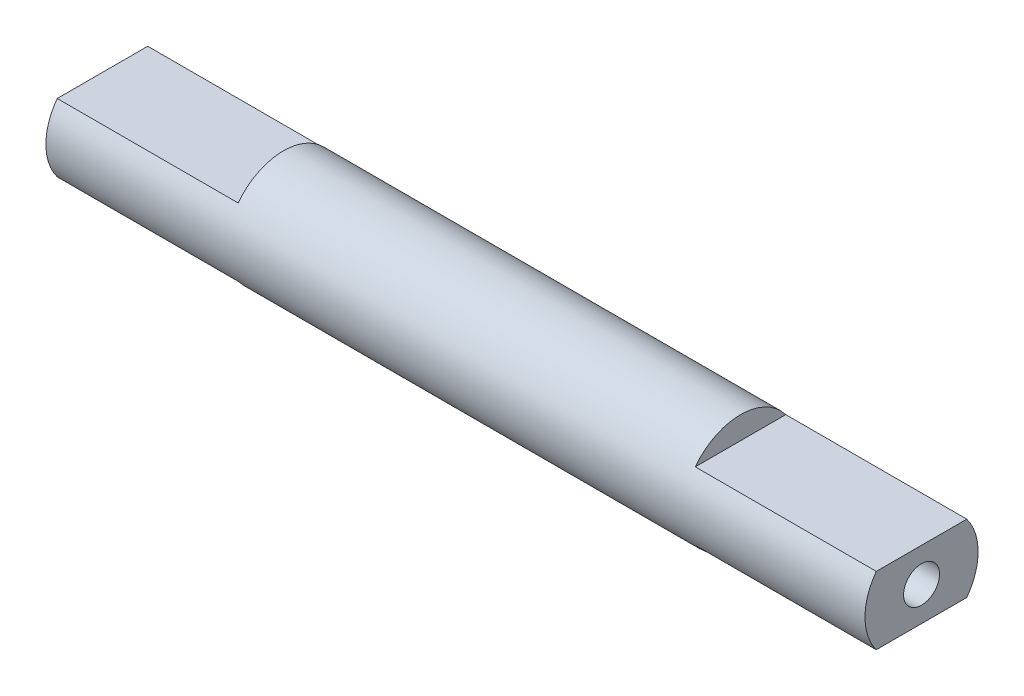
ISO-10303-21;
HEADER;
FILE_DESCRIPTION(('STEP AP214'),'2;1');
FILE_NAME('part.step','',(''),(''),'','','');
FILE_SCHEMA(('AUTOMOTIVE_DESIGN { 1 0 10303 214 1 1 1 1 }'));
ENDSEC;
DATA;
#1=APPLICATION_CONTEXT('core data for automotive mechanical design processes');
#2=APPLICATION_PROTOCOL_DEFINITION('international standard','automotive_design',2000,#1);
#3=PRODUCT_CONTEXT('',#1,'mechanical');
#4=PRODUCT('Part','Part','',(#3));
#5=PRODUCT_RELATED_PRODUCT_CATEGORY('part','',(#4));
#6=PRODUCT_DEFINITION_FORMATION('','',#4);
#7=PRODUCT_DEFINITION_CONTEXT('part definition',#1,'design');
#8=PRODUCT_DEFINITION('design','',#6,#7);
#9=PRODUCT_DEFINITION_SHAPE('','',#8);
#10=(LENGTH_UNIT() NAMED_UNIT(*) SI_UNIT(.MILLI.,.METRE.));
#11=(NAMED_UNIT(*) PLANE_ANGLE_UNIT() SI_UNIT($,.RADIAN.));
#12=(NAMED_UNIT(*) SI_UNIT($,.STERADIAN.) SOLID_ANGLE_UNIT());
#13=UNCERTAINTY_MEASURE_WITH_UNIT(LENGTH_MEASURE(1.E-05),#10,'distance_accuracy_value','');
#14=(GEOMETRIC_REPRESENTATION_CONTEXT(3) GLOBAL_UNCERTAINTY_ASSIGNED_CONTEXT((#13)) GLOBAL_UNIT_ASSIGNED_CONTEXT((#10,
#11,#12)) REPRESENTATION_CONTEXT('',''));
#15=CARTESIAN_POINT('',(0.,0.,0.));
#16=DIRECTION('',(0.,0.,1.));
#17=DIRECTION('',(1.,0.,0.));
#18=AXIS2_PLACEMENT_3D('',#15,#16,#17);
#19=CARTESIAN_POINT('',(36.2,0.,0.));
#20=DIRECTION('',(-1.,0.,0.));
#21=DIRECTION('',(0.,0.,1.));
#22=AXIS2_PLACEMENT_3D('',#19,#20,#21);
#23=CYLINDRICAL_SURFACE('',#22,2.5);
#24=CARTESIAN_POINT('',(8.,0.,0.));
#25=DIRECTION('',(1.,0.,0.));
#26=DIRECTION('',(0.,0.,-1.));
#27=AXIS2_PLACEMENT_3D('',#24,#25,#26);
#28=CIRCLE('',#27,2.5);
#29=CARTESIAN_POINT('',(8.,-1.5,2.));
#30=VERTEX_POINT('',#29);
#31=CARTESIAN_POINT('',(8.,-1.5,-2.));
#32=VERTEX_POINT('',#31);
#33=EDGE_CURVE('E62',#30,#32,#28,.T.);
#34=ORIENTED_EDGE('',*,*,#33,.T.);
#35=DIRECTION('',(-1.,0.,0.));
#36=VECTOR('',#35,1.);
#37=CARTESIAN_POINT('',(8.,-1.5,-2.));
#38=LINE('',#37,#36);
#39=CARTESIAN_POINT('',(0.,-1.5,-2.));
#40=VERTEX_POINT('',#39);
#41=EDGE_CURVE('E184',#32,#40,#38,.T.);
#42=ORIENTED_EDGE('',*,*,#41,.T.);
#43=CARTESIAN_POINT('',(0.,0.,0.));
#44=DIRECTION('',(1.,0.,0.));
#45=DIRECTION('',(0.,0.,-1.));
#46=AXIS2_PLACEMENT_3D('',#43,#44,#45);
#47=CIRCLE('',#46,2.5);
#48=CARTESIAN_POINT('',(0.,1.5,-2.));
#49=VERTEX_POINT('',#48);
#50=EDGE_CURVE('E138',#40,#49,#47,.T.);
#51=ORIENTED_EDGE('',*,*,#50,.T.);
#52=DIRECTION('',(-1.,0.,0.));
#53=VECTOR('',#52,1.);
#54=CARTESIAN_POINT('',(8.,1.5,-2.));
#55=LINE('',#54,#53);
#56=CARTESIAN_POINT('',(8.,1.5,-2.));
#57=VERTEX_POINT('',#56);
#58=EDGE_CURVE('E81',#57,#49,#55,.T.);
#59=ORIENTED_EDGE('',*,*,#58,.F.);
#60=CARTESIAN_POINT('',(8.,1.5,2.));
#61=VERTEX_POINT('',#60);
#62=EDGE_CURVE('E13',#57,#61,#28,.T.);
#63=ORIENTED_EDGE('',*,*,#62,.T.);
#64=DIRECTION('',(-1.,0.,0.));
#65=VECTOR('',#64,1.);
#66=CARTESIAN_POINT('',(8.,1.5,2.));
#67=LINE('',#66,#65);
#68=CARTESIAN_POINT('',(0.,1.5,2.));
#69=VERTEX_POINT('',#68);
#70=EDGE_CURVE('E129',#61,#69,#67,.T.);
#71=ORIENTED_EDGE('',*,*,#70,.T.);
#72=CARTESIAN_POINT('',(0.,-1.5,2.));
#73=VERTEX_POINT('',#72);
#74=EDGE_CURVE('E169',#69,#73,#47,.T.);
#75=ORIENTED_EDGE('',*,*,#74,.T.);
#76=DIRECTION('',(-1.,0.,0.));
#77=VECTOR('',#76,1.);
#78=CARTESIAN_POINT('',(8.,-1.5,2.));
#79=LINE('',#78,#77);
#80=EDGE_CURVE('E73',#30,#73,#79,.T.);
#81=ORIENTED_EDGE('',*,*,#80,.F.);
#82=EDGE_LOOP('',(#34,#42,#51,#59,#63,#71,#75,#81));
#83=FACE_BOUND('',#82,.T.);
#84=CARTESIAN_POINT('',(36.2,0.,0.));
#85=DIRECTION('',(1.,0.,0.));
#86=DIRECTION('',(0.,0.,-1.));
#87=AXIS2_PLACEMENT_3D('',#84,#85,#86);
#88=CIRCLE('',#87,2.5);
#89=CARTESIAN_POINT('',(36.2,1.5,2.));
#90=VERTEX_POINT('',#89);
#91=CARTESIAN_POINT('',(36.2,-1.5,2.));
#92=VERTEX_POINT('',#91);
#93=EDGE_CURVE('E168',#90,#92,#88,.T.);
#94=ORIENTED_EDGE('',*,*,#93,.F.);
#95=DIRECTION('',(-1.,0.,0.));
#96=VECTOR('',#95,1.);
#97=CARTESIAN_POINT('',(36.2,1.5,2.));
#98=LINE('',#97,#96);
#99=CARTESIAN_POINT('',(28.2,1.5,2.));
#100=VERTEX_POINT('',#99);
#101=EDGE_CURVE('E162',#90,#100,#98,.T.);
#102=ORIENTED_EDGE('',*,*,#101,.T.);
#103=CARTESIAN_POINT('',(28.2,0.,0.));
#104=DIRECTION('',(1.,0.,0.));
#105=DIRECTION('',(0.,0.,-1.));
#106=AXIS2_PLACEMENT_3D('',#103,#104,#105);
#107=CIRCLE('',#106,2.5);
#108=CARTESIAN_POINT('',(28.2,1.5,-2.));
#109=VERTEX_POINT('',#108);
#110=EDGE_CURVE('E176',#109,#100,#107,.T.);
#111=ORIENTED_EDGE('',*,*,#110,.F.);
#112=DIRECTION('',(-1.,0.,0.));
#113=VECTOR('',#112,1.);
#114=CARTESIAN_POINT('',(36.2,1.5,-2.));
#115=LINE('',#114,#113);
#116=CARTESIAN_POINT('',(36.2,1.5,-2.));
#117=VERTEX_POINT('',#116);
#118=EDGE_CURVE('E159',#109,#117,#115,.F.);
#119=ORIENTED_EDGE('',*,*,#118,.T.);
#120=CARTESIAN_POINT('',(36.2,-1.5,-2.));
#121=VERTEX_POINT('',#120);
#122=EDGE_CURVE('E165',#121,#117,#88,.T.);
#123=ORIENTED_EDGE('',*,*,#122,.F.);
#124=DIRECTION('',(-1.,0.,0.));
#125=VECTOR('',#124,1.);
#126=CARTESIAN_POINT('',(36.2,-1.5,-2.));
#127=LINE('',#126,#125);
#128=CARTESIAN_POINT('',(28.2,-1.5,-2.));
#129=VERTEX_POINT('',#128);
#130=EDGE_CURVE('E155',#129,#121,#127,.F.);
#131=ORIENTED_EDGE('',*,*,#130,.F.);
#132=CARTESIAN_POINT('',(28.2,-1.5,2.));
#133=VERTEX_POINT('',#132);
#134=EDGE_CURVE('E175',#133,#129,#107,.T.);
#135=ORIENTED_EDGE('',*,*,#134,.F.);
#136=DIRECTION('',(-1.,0.,0.));
#137=VECTOR('',#136,1.);
#138=CARTESIAN_POINT('',(36.2,-1.5,2.));
#139=LINE('',#138,#137);
#140=EDGE_CURVE('E157',#92,#133,#139,.T.);
#141=ORIENTED_EDGE('',*,*,#140,.F.);
#142=EDGE_LOOP('',(#94,#102,#111,#119,#123,#131,#135,#141));
#143=FACE_BOUND('',#142,.T.);
#144=ADVANCED_FACE('F59',(#83,#143),#23,.T.);
#145=CARTESIAN_POINT('',(36.2,0.,0.));
#146=DIRECTION('',(1.,0.,0.));
#147=DIRECTION('',(0.,0.,-1.));
#148=AXIS2_PLACEMENT_3D('',#145,#146,#147);
#149=PLANE('',#148);
#150=CARTESIAN_POINT('',(36.2,0.,0.));
#151=DIRECTION('',(1.,0.,0.));
#152=DIRECTION('',(0.,0.,-1.));
#153=AXIS2_PLACEMENT_3D('',#150,#151,#152);
#154=CIRCLE('',#153,0.79375);
#155=CARTESIAN_POINT('',(36.2,0.,-0.793749999999999));
#156=VERTEX_POINT('',#155);
#157=EDGE_CURVE('E139',#156,#156,#154,.T.);
#158=ORIENTED_EDGE('',*,*,#157,.F.);
#159=EDGE_LOOP('',(#158));
#160=FACE_BOUND('',#159,.T.);
#161=DIRECTION('',(0.,0.,-1.));
#162=VECTOR('',#161,1.);
#163=CARTESIAN_POINT('',(36.2,1.5,0.));
#164=LINE('',#163,#162);
#165=EDGE_CURVE('E174',#90,#117,#164,.T.);
#166=ORIENTED_EDGE('',*,*,#165,.F.);
#167=ORIENTED_EDGE('',*,*,#93,.T.);
#168=DIRECTION('',(0.,0.,-1.));
#169=VECTOR('',#168,1.);
#170=CARTESIAN_POINT('',(36.2,-1.5,0.));
#171=LINE('',#170,#169);
#172=EDGE_CURVE('E171',#92,#121,#171,.T.);
#173=ORIENTED_EDGE('',*,*,#172,.T.);
#174=ORIENTED_EDGE('',*,*,#122,.T.);
#175=EDGE_LOOP('',(#166,#167,#173,#174));
#176=FACE_BOUND('',#175,.T.);
#177=ADVANCED_FACE('F201',(#160,#176),#149,.T.);
#178=CARTESIAN_POINT('',(0.,0.,0.));
#179=DIRECTION('',(1.,0.,0.));
#180=DIRECTION('',(0.,0.,-1.));
#181=AXIS2_PLACEMENT_3D('',#178,#179,#180);
#182=PLANE('',#181);
#183=CARTESIAN_POINT('',(0.,0.,0.));
#184=DIRECTION('',(-1.,0.,0.));
#185=DIRECTION('',(0.,0.,1.));
#186=AXIS2_PLACEMENT_3D('',#183,#184,#185);
#187=CIRCLE('',#186,0.79375);
#188=CARTESIAN_POINT('',(0.,0.,0.79375));
#189=VERTEX_POINT('',#188);
#190=EDGE_CURVE('E339',#189,#189,#187,.T.);
#191=ORIENTED_EDGE('',*,*,#190,.F.);
#192=EDGE_LOOP('',(#191));
#193=FACE_BOUND('',#192,.T.);
#194=ORIENTED_EDGE('',*,*,#74,.F.);
#195=DIRECTION('',(0.,0.,1.));
#196=VECTOR('',#195,1.);
#197=CARTESIAN_POINT('',(0.,1.5,-2.));
#198=LINE('',#197,#196);
#199=EDGE_CURVE('E193',#49,#69,#198,.T.);
#200=ORIENTED_EDGE('',*,*,#199,.F.);
#201=ORIENTED_EDGE('',*,*,#50,.F.);
#202=DIRECTION('',(0.,0.,-1.));
#203=VECTOR('',#202,1.);
#204=CARTESIAN_POINT('',(0.,-1.5,2.));
#205=LINE('',#204,#203);
#206=EDGE_CURVE('E131',#73,#40,#205,.T.);
#207=ORIENTED_EDGE('',*,*,#206,.F.);
#208=EDGE_LOOP('',(#194,#200,#201,#207));
#209=FACE_BOUND('',#208,.T.);
#210=ADVANCED_FACE('F198',(#193,#209),#182,.F.);
#211=CARTESIAN_POINT('',(28.2,-1.5,2.59331593176098));
#212=DIRECTION('',(0.,-1.,0.));
#213=DIRECTION('',(0.,0.,-1.));
#214=AXIS2_PLACEMENT_3D('',#211,#212,#213);
#215=PLANE('',#214);
#216=ORIENTED_EDGE('',*,*,#140,.T.);
#217=DIRECTION('',(0.,0.,-1.));
#218=VECTOR('',#217,1.);
#219=CARTESIAN_POINT('',(28.2,-1.5,2.59331593176098));
#220=LINE('',#219,#218);
#221=EDGE_CURVE('E152',#133,#129,#220,.T.);
#222=ORIENTED_EDGE('',*,*,#221,.T.);
#223=ORIENTED_EDGE('',*,*,#130,.T.);
#224=ORIENTED_EDGE('',*,*,#172,.F.);
#225=EDGE_LOOP('',(#216,#222,#223,#224));
#226=FACE_BOUND('',#225,.T.);
#227=ADVANCED_FACE('F200',(#226),#215,.T.);
#228=CARTESIAN_POINT('',(28.2,0.,0.));
#229=DIRECTION('',(1.,0.,0.));
#230=DIRECTION('',(0.,0.,-1.));
#231=AXIS2_PLACEMENT_3D('',#228,#229,#230);
#232=PLANE('',#231);
#233=ORIENTED_EDGE('',*,*,#134,.T.);
#234=ORIENTED_EDGE('',*,*,#221,.F.);
#235=EDGE_LOOP('',(#233,#234));
#236=FACE_BOUND('',#235,.T.);
#237=ADVANCED_FACE('F207',(#236),#232,.T.);
#238=ORIENTED_EDGE('',*,*,#110,.T.);
#239=DIRECTION('',(0.,0.,-1.));
#240=VECTOR('',#239,1.);
#241=CARTESIAN_POINT('',(28.2,1.5,2.59331593176098));
#242=LINE('',#241,#240);
#243=EDGE_CURVE('E148',#100,#109,#242,.T.);
#244=ORIENTED_EDGE('',*,*,#243,.T.);
#245=EDGE_LOOP('',(#238,#244));
#246=FACE_BOUND('',#245,.T.);
#247=ADVANCED_FACE('F305',(#246),#232,.T.);
#248=CARTESIAN_POINT('',(28.2,1.5,2.59331593176098));
#249=DIRECTION('',(0.,-1.,0.));
#250=DIRECTION('',(0.,0.,-1.));
#251=AXIS2_PLACEMENT_3D('',#248,#249,#250);
#252=PLANE('',#251);
#253=ORIENTED_EDGE('',*,*,#165,.T.);
#254=ORIENTED_EDGE('',*,*,#118,.F.);
#255=ORIENTED_EDGE('',*,*,#243,.F.);
#256=ORIENTED_EDGE('',*,*,#101,.F.);
#257=EDGE_LOOP('',(#253,#254,#255,#256));
#258=FACE_BOUND('',#257,.T.);
#259=ADVANCED_FACE('F229',(#258),#252,.F.);
#260=CARTESIAN_POINT('',(31.2,0.,0.));
#261=DIRECTION('',(1.,0.,0.));
#262=DIRECTION('',(0.,0.,-1.));
#263=AXIS2_PLACEMENT_3D('',#260,#261,#262);
#264=CYLINDRICAL_SURFACE('',#263,0.79375);
#265=CARTESIAN_POINT('',(31.2,0.,0.));
#266=DIRECTION('',(1.,0.,0.));
#267=DIRECTION('',(0.,0.,-1.));
#268=AXIS2_PLACEMENT_3D('',#265,#266,#267);
#269=CIRCLE('',#268,0.79375);
#270=CARTESIAN_POINT('',(31.2,0.,-0.793749999999999));
#271=VERTEX_POINT('',#270);
#272=EDGE_CURVE('E142',#271,#271,#269,.T.);
#273=ORIENTED_EDGE('',*,*,#272,.F.);
#274=EDGE_LOOP('',(#273));
#275=FACE_BOUND('',#274,.T.);
#276=ORIENTED_EDGE('',*,*,#157,.T.);
#277=EDGE_LOOP('',(#276));
#278=FACE_BOUND('',#277,.T.);
#279=ADVANCED_FACE('F234',(#275,#278),#264,.F.);
#280=CARTESIAN_POINT('',(31.2,0.,0.));
#281=DIRECTION('',(1.,0.,0.));
#282=DIRECTION('',(0.,0.,-1.));
#283=AXIS2_PLACEMENT_3D('',#280,#281,#282);
#284=PLANE('',#283);
#285=ORIENTED_EDGE('',*,*,#272,.T.);
#286=EDGE_LOOP('',(#285));
#287=FACE_BOUND('',#286,.T.);
#288=ADVANCED_FACE('F238',(#287),#284,.T.);
#289=CARTESIAN_POINT('',(8.,-1.5,2.));
#290=DIRECTION('',(0.,1.,0.));
#291=DIRECTION('',(0.,0.,1.));
#292=AXIS2_PLACEMENT_3D('',#289,#290,#291);
#293=PLANE('',#292);
#294=ORIENTED_EDGE('',*,*,#206,.T.);
#295=ORIENTED_EDGE('',*,*,#41,.F.);
#296=DIRECTION('',(0.,0.,-1.));
#297=VECTOR('',#296,1.);
#298=CARTESIAN_POINT('',(8.,-1.5,2.));
#299=LINE('',#298,#297);
#300=EDGE_CURVE('E130',#30,#32,#299,.T.);
#301=ORIENTED_EDGE('',*,*,#300,.F.);
#302=ORIENTED_EDGE('',*,*,#80,.T.);
#303=EDGE_LOOP('',(#294,#295,#301,#302));
#304=FACE_BOUND('',#303,.T.);
#305=ADVANCED_FACE('F188',(#304),#293,.F.);
#306=CARTESIAN_POINT('',(8.,0.,0.));
#307=DIRECTION('',(1.,0.,0.));
#308=DIRECTION('',(0.,0.,-1.));
#309=AXIS2_PLACEMENT_3D('',#306,#307,#308);
#310=PLANE('',#309);
#311=ORIENTED_EDGE('',*,*,#300,.T.);
#312=ORIENTED_EDGE('',*,*,#33,.F.);
#313=EDGE_LOOP('',(#311,#312));
#314=FACE_BOUND('',#313,.T.);
#315=ADVANCED_FACE('F187',(#314),#310,.F.);
#316=DIRECTION('',(0.,0.,1.));
#317=VECTOR('',#316,1.);
#318=CARTESIAN_POINT('',(8.,1.5,-2.));
#319=LINE('',#318,#317);
#320=EDGE_CURVE('E124',#57,#61,#319,.T.);
#321=ORIENTED_EDGE('',*,*,#320,.T.);
#322=ORIENTED_EDGE('',*,*,#62,.F.);
#323=EDGE_LOOP('',(#321,#322));
#324=FACE_BOUND('',#323,.T.);
#325=ADVANCED_FACE('F123',(#324),#310,.F.);
#326=CARTESIAN_POINT('',(8.,1.5,-2.));
#327=DIRECTION('',(0.,-1.,0.));
#328=DIRECTION('',(0.,0.,-1.));
#329=AXIS2_PLACEMENT_3D('',#326,#327,#328);
#330=PLANE('',#329);
#331=ORIENTED_EDGE('',*,*,#199,.T.);
#332=ORIENTED_EDGE('',*,*,#70,.F.);
#333=ORIENTED_EDGE('',*,*,#320,.F.);
#334=ORIENTED_EDGE('',*,*,#58,.T.);
#335=EDGE_LOOP('',(#331,#332,#333,#334));
#336=FACE_BOUND('',#335,.T.);
#337=ADVANCED_FACE('F128',(#336),#330,.F.);
#338=CARTESIAN_POINT('',(5.,0.,0.));
#339=DIRECTION('',(-1.,0.,0.));
#340=DIRECTION('',(0.,0.,1.));
#341=AXIS2_PLACEMENT_3D('',#338,#339,#340);
#342=CYLINDRICAL_SURFACE('',#341,0.79375);
#343=CARTESIAN_POINT('',(5.,0.,0.));
#344=DIRECTION('',(-1.,0.,0.));
#345=DIRECTION('',(0.,0.,1.));
#346=AXIS2_PLACEMENT_3D('',#343,#344,#345);
#347=CIRCLE('',#346,0.79375);
#348=CARTESIAN_POINT('',(5.,0.,0.79375));
#349=VERTEX_POINT('',#348);
#350=EDGE_CURVE('E195',#349,#349,#347,.T.);
#351=ORIENTED_EDGE('',*,*,#350,.F.);
#352=EDGE_LOOP('',(#351));
#353=FACE_BOUND('',#352,.T.);
#354=ORIENTED_EDGE('',*,*,#190,.T.);
#355=EDGE_LOOP('',(#354));
#356=FACE_BOUND('',#355,.T.);
#357=ADVANCED_FACE('F272',(#353,#356),#342,.F.);
#358=CARTESIAN_POINT('',(5.,0.,0.));
#359=DIRECTION('',(-1.,0.,0.));
#360=DIRECTION('',(0.,0.,1.));
#361=AXIS2_PLACEMENT_3D('',#358,#359,#360);
#362=PLANE('',#361);
#363=ORIENTED_EDGE('',*,*,#350,.T.);
#364=EDGE_LOOP('',(#363));
#365=FACE_BOUND('',#364,.T.);
#366=ADVANCED_FACE('F279',(#365),#362,.T.);
#367=CLOSED_SHELL('',(#144,#177,#210,#227,#237,#247,#259,#279,#288,#305,#315,#325,#337,#357,#366));
#368=MANIFOLD_SOLID_BREP('B2',#367);
#369=ADVANCED_BREP_SHAPE_REPRESENTATION('',(#18,#368),#14);
#370=SHAPE_DEFINITION_REPRESENTATION(#9,#369);
ENDSEC;
END-ISO-10303-21;
